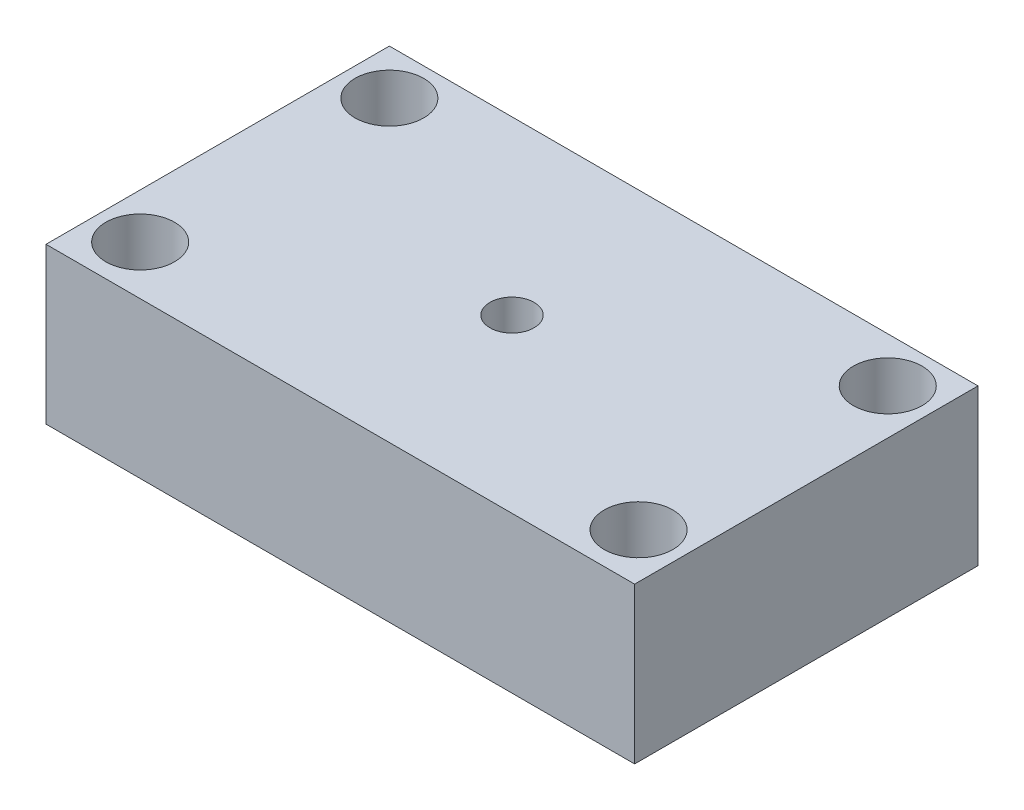
ISO-10303-21;
HEADER;
FILE_DESCRIPTION(('STEP AP214'),'2;1');
FILE_NAME('part.step','',(''),(''),'','','');
FILE_SCHEMA(('AUTOMOTIVE_DESIGN { 1 0 10303 214 1 1 1 1 }'));
ENDSEC;
DATA;
#1=APPLICATION_CONTEXT('core data for automotive mechanical design processes');
#2=APPLICATION_PROTOCOL_DEFINITION('international standard','automotive_design',2000,#1);
#3=PRODUCT_CONTEXT('',#1,'mechanical');
#4=PRODUCT('Part','Part','',(#3));
#5=PRODUCT_RELATED_PRODUCT_CATEGORY('part','',(#4));
#6=PRODUCT_DEFINITION_FORMATION('','',#4);
#7=PRODUCT_DEFINITION_CONTEXT('part definition',#1,'design');
#8=PRODUCT_DEFINITION('design','',#6,#7);
#9=PRODUCT_DEFINITION_SHAPE('','',#8);
#10=(LENGTH_UNIT() NAMED_UNIT(*) SI_UNIT(.MILLI.,.METRE.));
#11=(NAMED_UNIT(*) PLANE_ANGLE_UNIT() SI_UNIT($,.RADIAN.));
#12=(NAMED_UNIT(*) SI_UNIT($,.STERADIAN.) SOLID_ANGLE_UNIT());
#13=UNCERTAINTY_MEASURE_WITH_UNIT(LENGTH_MEASURE(1.E-05),#10,'distance_accuracy_value','');
#14=(GEOMETRIC_REPRESENTATION_CONTEXT(3) GLOBAL_UNCERTAINTY_ASSIGNED_CONTEXT((#13)) GLOBAL_UNIT_ASSIGNED_CONTEXT((#10,
#11,#12)) REPRESENTATION_CONTEXT('',''));
#15=CARTESIAN_POINT('',(0.,0.,0.));
#16=DIRECTION('',(0.,0.,1.));
#17=DIRECTION('',(1.,0.,0.));
#18=AXIS2_PLACEMENT_3D('',#15,#16,#17);
#19=CARTESIAN_POINT('',(0.,15.875,0.));
#20=DIRECTION('',(0.,-1.,0.));
#21=DIRECTION('',(0.,0.,-1.));
#22=AXIS2_PLACEMENT_3D('',#19,#20,#21);
#23=PLANE('',#22);
#24=DIRECTION('',(0.,0.,1.));
#25=VECTOR('',#24,1.);
#26=CARTESIAN_POINT('',(0.,15.875,0.));
#27=LINE('',#26,#25);
#28=CARTESIAN_POINT('',(0.,15.875,-35.));
#29=VERTEX_POINT('',#28);
#30=CARTESIAN_POINT('',(0.,15.875,0.));
#31=VERTEX_POINT('',#30);
#32=EDGE_CURVE('E96',#29,#31,#27,.T.);
#33=ORIENTED_EDGE('',*,*,#32,.T.);
#34=DIRECTION('',(1.,0.,0.));
#35=VECTOR('',#34,1.);
#36=CARTESIAN_POINT('',(0.,15.875,0.));
#37=LINE('',#36,#35);
#38=CARTESIAN_POINT('',(60.,15.875,0.));
#39=VERTEX_POINT('',#38);
#40=EDGE_CURVE('E91',#31,#39,#37,.T.);
#41=ORIENTED_EDGE('',*,*,#40,.T.);
#42=DIRECTION('',(0.,0.,-1.));
#43=VECTOR('',#42,1.);
#44=CARTESIAN_POINT('',(60.,15.875,0.));
#45=LINE('',#44,#43);
#46=CARTESIAN_POINT('',(60.,15.875,-35.));
#47=VERTEX_POINT('',#46);
#48=EDGE_CURVE('E94',#39,#47,#45,.T.);
#49=ORIENTED_EDGE('',*,*,#48,.T.);
#50=DIRECTION('',(-1.,0.,0.));
#51=VECTOR('',#50,1.);
#52=CARTESIAN_POINT('',(0.,15.875,-35.));
#53=LINE('',#52,#51);
#54=EDGE_CURVE('E61',#47,#29,#53,.T.);
#55=ORIENTED_EDGE('',*,*,#54,.T.);
#56=EDGE_LOOP('',(#33,#41,#49,#55));
#57=FACE_BOUND('',#56,.T.);
#58=CARTESIAN_POINT('',(4.6,15.875,-30.4));
#59=DIRECTION('',(0.,1.,0.));
#60=DIRECTION('',(0.,0.,1.));
#61=AXIS2_PLACEMENT_3D('',#58,#59,#60);
#62=CIRCLE('',#61,3.5);
#63=CARTESIAN_POINT('',(4.6,15.875,-26.9));
#64=VERTEX_POINT('',#63);
#65=EDGE_CURVE('E116',#64,#64,#62,.T.);
#66=ORIENTED_EDGE('',*,*,#65,.F.);
#67=EDGE_LOOP('',(#66));
#68=FACE_BOUND('',#67,.T.);
#69=CARTESIAN_POINT('',(55.4,15.875,-30.4));
#70=DIRECTION('',(0.,1.,0.));
#71=DIRECTION('',(0.,0.,1.));
#72=AXIS2_PLACEMENT_3D('',#69,#70,#71);
#73=CIRCLE('',#72,3.5);
#74=CARTESIAN_POINT('',(55.4,15.875,-26.9));
#75=VERTEX_POINT('',#74);
#76=EDGE_CURVE('E138',#75,#75,#73,.T.);
#77=ORIENTED_EDGE('',*,*,#76,.F.);
#78=EDGE_LOOP('',(#77));
#79=FACE_BOUND('',#78,.T.);
#80=CARTESIAN_POINT('',(4.6,15.875,-5.));
#81=DIRECTION('',(0.,1.,0.));
#82=DIRECTION('',(0.,0.,1.));
#83=AXIS2_PLACEMENT_3D('',#80,#81,#82);
#84=CIRCLE('',#83,3.5);
#85=CARTESIAN_POINT('',(4.6,15.875,-1.5));
#86=VERTEX_POINT('',#85);
#87=EDGE_CURVE('E146',#86,#86,#84,.T.);
#88=ORIENTED_EDGE('',*,*,#87,.F.);
#89=EDGE_LOOP('',(#88));
#90=FACE_BOUND('',#89,.T.);
#91=CARTESIAN_POINT('',(55.4,15.875,-5.));
#92=DIRECTION('',(0.,1.,0.));
#93=DIRECTION('',(0.,0.,1.));
#94=AXIS2_PLACEMENT_3D('',#91,#92,#93);
#95=CIRCLE('',#94,3.5);
#96=CARTESIAN_POINT('',(55.4,15.875,-1.5));
#97=VERTEX_POINT('',#96);
#98=EDGE_CURVE('E154',#97,#97,#95,.T.);
#99=ORIENTED_EDGE('',*,*,#98,.F.);
#100=EDGE_LOOP('',(#99));
#101=FACE_BOUND('',#100,.T.);
#102=CARTESIAN_POINT('',(30.,15.875,-17.5));
#103=DIRECTION('',(0.,1.,0.));
#104=DIRECTION('',(0.,0.,1.));
#105=AXIS2_PLACEMENT_3D('',#102,#103,#104);
#106=CIRCLE('',#105,2.25);
#107=CARTESIAN_POINT('',(30.,15.875,-15.25));
#108=VERTEX_POINT('',#107);
#109=EDGE_CURVE('E162',#108,#108,#106,.T.);
#110=ORIENTED_EDGE('',*,*,#109,.F.);
#111=EDGE_LOOP('',(#110));
#112=FACE_BOUND('',#111,.T.);
#113=ADVANCED_FACE('F43',(#57,#68,#79,#90,#101,#112),#23,.F.);
#114=CARTESIAN_POINT('',(0.,0.,0.));
#115=DIRECTION('',(0.,-1.,0.));
#116=DIRECTION('',(0.,0.,-1.));
#117=AXIS2_PLACEMENT_3D('',#114,#115,#116);
#118=PLANE('',#117);
#119=CARTESIAN_POINT('',(55.4,0.,-5.));
#120=DIRECTION('',(0.,1.,0.));
#121=DIRECTION('',(0.,0.,1.));
#122=AXIS2_PLACEMENT_3D('',#119,#120,#121);
#123=CIRCLE('',#122,3.5);
#124=CARTESIAN_POINT('',(55.4,0.,-1.5));
#125=VERTEX_POINT('',#124);
#126=EDGE_CURVE('E158',#125,#125,#123,.T.);
#127=ORIENTED_EDGE('',*,*,#126,.T.);
#128=EDGE_LOOP('',(#127));
#129=FACE_BOUND('',#128,.T.);
#130=CARTESIAN_POINT('',(55.4,0.,-30.4));
#131=DIRECTION('',(0.,1.,0.));
#132=DIRECTION('',(0.,0.,1.));
#133=AXIS2_PLACEMENT_3D('',#130,#131,#132);
#134=CIRCLE('',#133,3.5);
#135=CARTESIAN_POINT('',(55.4,0.,-26.9));
#136=VERTEX_POINT('',#135);
#137=EDGE_CURVE('E142',#136,#136,#134,.T.);
#138=ORIENTED_EDGE('',*,*,#137,.T.);
#139=EDGE_LOOP('',(#138));
#140=FACE_BOUND('',#139,.T.);
#141=DIRECTION('',(0.,0.,1.));
#142=VECTOR('',#141,1.);
#143=CARTESIAN_POINT('',(0.,0.,0.));
#144=LINE('',#143,#142);
#145=CARTESIAN_POINT('',(0.,0.,-35.));
#146=VERTEX_POINT('',#145);
#147=CARTESIAN_POINT('',(0.,0.,0.));
#148=VERTEX_POINT('',#147);
#149=EDGE_CURVE('E112',#146,#148,#144,.T.);
#150=ORIENTED_EDGE('',*,*,#149,.F.);
#151=DIRECTION('',(-1.,0.,0.));
#152=VECTOR('',#151,1.);
#153=CARTESIAN_POINT('',(0.,0.,-35.));
#154=LINE('',#153,#152);
#155=CARTESIAN_POINT('',(60.,0.,-35.));
#156=VERTEX_POINT('',#155);
#157=EDGE_CURVE('E84',#156,#146,#154,.T.);
#158=ORIENTED_EDGE('',*,*,#157,.F.);
#159=DIRECTION('',(0.,0.,-1.));
#160=VECTOR('',#159,1.);
#161=CARTESIAN_POINT('',(60.,0.,0.));
#162=LINE('',#161,#160);
#163=CARTESIAN_POINT('',(60.,0.,0.));
#164=VERTEX_POINT('',#163);
#165=EDGE_CURVE('E78',#164,#156,#162,.T.);
#166=ORIENTED_EDGE('',*,*,#165,.F.);
#167=DIRECTION('',(1.,0.,0.));
#168=VECTOR('',#167,1.);
#169=CARTESIAN_POINT('',(0.,0.,0.));
#170=LINE('',#169,#168);
#171=EDGE_CURVE('E101',#148,#164,#170,.T.);
#172=ORIENTED_EDGE('',*,*,#171,.F.);
#173=EDGE_LOOP('',(#150,#158,#166,#172));
#174=FACE_BOUND('',#173,.T.);
#175=CARTESIAN_POINT('',(4.6,0.,-30.4));
#176=DIRECTION('',(0.,1.,0.));
#177=DIRECTION('',(0.,0.,1.));
#178=AXIS2_PLACEMENT_3D('',#175,#176,#177);
#179=CIRCLE('',#178,3.5);
#180=CARTESIAN_POINT('',(4.6,0.,-26.9));
#181=VERTEX_POINT('',#180);
#182=EDGE_CURVE('E134',#181,#181,#179,.T.);
#183=ORIENTED_EDGE('',*,*,#182,.T.);
#184=EDGE_LOOP('',(#183));
#185=FACE_BOUND('',#184,.T.);
#186=CARTESIAN_POINT('',(4.6,0.,-5.));
#187=DIRECTION('',(0.,1.,0.));
#188=DIRECTION('',(0.,0.,1.));
#189=AXIS2_PLACEMENT_3D('',#186,#187,#188);
#190=CIRCLE('',#189,3.5);
#191=CARTESIAN_POINT('',(4.6,0.,-1.5));
#192=VERTEX_POINT('',#191);
#193=EDGE_CURVE('E150',#192,#192,#190,.T.);
#194=ORIENTED_EDGE('',*,*,#193,.T.);
#195=EDGE_LOOP('',(#194));
#196=FACE_BOUND('',#195,.T.);
#197=CARTESIAN_POINT('',(30.,0.,-17.5));
#198=DIRECTION('',(0.,1.,0.));
#199=DIRECTION('',(0.,0.,1.));
#200=AXIS2_PLACEMENT_3D('',#197,#198,#199);
#201=CIRCLE('',#200,2.25);
#202=CARTESIAN_POINT('',(30.,0.,-15.25));
#203=VERTEX_POINT('',#202);
#204=EDGE_CURVE('E166',#203,#203,#201,.T.);
#205=ORIENTED_EDGE('',*,*,#204,.T.);
#206=EDGE_LOOP('',(#205));
#207=FACE_BOUND('',#206,.T.);
#208=ADVANCED_FACE('F129',(#129,#140,#174,#185,#196,#207),#118,.T.);
#209=CARTESIAN_POINT('',(0.,15.875,0.));
#210=DIRECTION('',(1.,0.,0.));
#211=DIRECTION('',(0.,0.,-1.));
#212=AXIS2_PLACEMENT_3D('',#209,#210,#211);
#213=PLANE('',#212);
#214=ORIENTED_EDGE('',*,*,#149,.T.);
#215=DIRECTION('',(0.,-1.,0.));
#216=VECTOR('',#215,1.);
#217=CARTESIAN_POINT('',(0.,15.875,0.));
#218=LINE('',#217,#216);
#219=EDGE_CURVE('E11',#31,#148,#218,.T.);
#220=ORIENTED_EDGE('',*,*,#219,.F.);
#221=ORIENTED_EDGE('',*,*,#32,.F.);
#222=DIRECTION('',(0.,-1.,0.));
#223=VECTOR('',#222,1.);
#224=CARTESIAN_POINT('',(0.,15.875,-35.));
#225=LINE('',#224,#223);
#226=EDGE_CURVE('E108',#29,#146,#225,.T.);
#227=ORIENTED_EDGE('',*,*,#226,.T.);
#228=EDGE_LOOP('',(#214,#220,#221,#227));
#229=FACE_BOUND('',#228,.T.);
#230=ADVANCED_FACE('F45',(#229),#213,.F.);
#231=CARTESIAN_POINT('',(0.,15.875,0.));
#232=DIRECTION('',(0.,0.,-1.));
#233=DIRECTION('',(-1.,0.,0.));
#234=AXIS2_PLACEMENT_3D('',#231,#232,#233);
#235=PLANE('',#234);
#236=ORIENTED_EDGE('',*,*,#171,.T.);
#237=DIRECTION('',(0.,-1.,0.));
#238=VECTOR('',#237,1.);
#239=CARTESIAN_POINT('',(60.,15.875,0.));
#240=LINE('',#239,#238);
#241=EDGE_CURVE('E53',#39,#164,#240,.T.);
#242=ORIENTED_EDGE('',*,*,#241,.F.);
#243=ORIENTED_EDGE('',*,*,#40,.F.);
#244=ORIENTED_EDGE('',*,*,#219,.T.);
#245=EDGE_LOOP('',(#236,#242,#243,#244));
#246=FACE_BOUND('',#245,.T.);
#247=ADVANCED_FACE('F100',(#246),#235,.F.);
#248=CARTESIAN_POINT('',(60.,15.875,0.));
#249=DIRECTION('',(-1.,0.,0.));
#250=DIRECTION('',(0.,0.,1.));
#251=AXIS2_PLACEMENT_3D('',#248,#249,#250);
#252=PLANE('',#251);
#253=ORIENTED_EDGE('',*,*,#165,.T.);
#254=DIRECTION('',(0.,-1.,0.));
#255=VECTOR('',#254,1.);
#256=CARTESIAN_POINT('',(60.,15.875,-35.));
#257=LINE('',#256,#255);
#258=EDGE_CURVE('E103',#47,#156,#257,.T.);
#259=ORIENTED_EDGE('',*,*,#258,.F.);
#260=ORIENTED_EDGE('',*,*,#48,.F.);
#261=ORIENTED_EDGE('',*,*,#241,.T.);
#262=EDGE_LOOP('',(#253,#259,#260,#261));
#263=FACE_BOUND('',#262,.T.);
#264=ADVANCED_FACE('F104',(#263),#252,.F.);
#265=CARTESIAN_POINT('',(0.,15.875,-35.));
#266=DIRECTION('',(0.,0.,1.));
#267=DIRECTION('',(1.,0.,0.));
#268=AXIS2_PLACEMENT_3D('',#265,#266,#267);
#269=PLANE('',#268);
#270=ORIENTED_EDGE('',*,*,#157,.T.);
#271=ORIENTED_EDGE('',*,*,#226,.F.);
#272=ORIENTED_EDGE('',*,*,#54,.F.);
#273=ORIENTED_EDGE('',*,*,#258,.T.);
#274=EDGE_LOOP('',(#270,#271,#272,#273));
#275=FACE_BOUND('',#274,.T.);
#276=ADVANCED_FACE('F126',(#275),#269,.F.);
#277=CARTESIAN_POINT('',(4.6,15.875,-30.4));
#278=DIRECTION('',(0.,-1.,0.));
#279=DIRECTION('',(0.,0.,-1.));
#280=AXIS2_PLACEMENT_3D('',#277,#278,#279);
#281=CYLINDRICAL_SURFACE('',#280,3.5);
#282=ORIENTED_EDGE('',*,*,#65,.T.);
#283=EDGE_LOOP('',(#282));
#284=FACE_BOUND('',#283,.T.);
#285=ORIENTED_EDGE('',*,*,#182,.F.);
#286=EDGE_LOOP('',(#285));
#287=FACE_BOUND('',#286,.T.);
#288=ADVANCED_FACE('F185',(#284,#287),#281,.F.);
#289=CARTESIAN_POINT('',(55.4,15.875,-30.4));
#290=DIRECTION('',(0.,-1.,0.));
#291=DIRECTION('',(0.,0.,-1.));
#292=AXIS2_PLACEMENT_3D('',#289,#290,#291);
#293=CYLINDRICAL_SURFACE('',#292,3.5);
#294=ORIENTED_EDGE('',*,*,#76,.T.);
#295=EDGE_LOOP('',(#294));
#296=FACE_BOUND('',#295,.T.);
#297=ORIENTED_EDGE('',*,*,#137,.F.);
#298=EDGE_LOOP('',(#297));
#299=FACE_BOUND('',#298,.T.);
#300=ADVANCED_FACE('F239',(#296,#299),#293,.F.);
#301=CARTESIAN_POINT('',(4.6,15.875,-5.));
#302=DIRECTION('',(0.,-1.,0.));
#303=DIRECTION('',(0.,0.,-1.));
#304=AXIS2_PLACEMENT_3D('',#301,#302,#303);
#305=CYLINDRICAL_SURFACE('',#304,3.5);
#306=ORIENTED_EDGE('',*,*,#87,.T.);
#307=EDGE_LOOP('',(#306));
#308=FACE_BOUND('',#307,.T.);
#309=ORIENTED_EDGE('',*,*,#193,.F.);
#310=EDGE_LOOP('',(#309));
#311=FACE_BOUND('',#310,.T.);
#312=ADVANCED_FACE('F248',(#308,#311),#305,.F.);
#313=CARTESIAN_POINT('',(55.4,15.875,-5.));
#314=DIRECTION('',(0.,-1.,0.));
#315=DIRECTION('',(0.,0.,-1.));
#316=AXIS2_PLACEMENT_3D('',#313,#314,#315);
#317=CYLINDRICAL_SURFACE('',#316,3.5);
#318=ORIENTED_EDGE('',*,*,#98,.T.);
#319=EDGE_LOOP('',(#318));
#320=FACE_BOUND('',#319,.T.);
#321=ORIENTED_EDGE('',*,*,#126,.F.);
#322=EDGE_LOOP('',(#321));
#323=FACE_BOUND('',#322,.T.);
#324=ADVANCED_FACE('F257',(#320,#323),#317,.F.);
#325=CARTESIAN_POINT('',(30.,15.875,-17.5));
#326=DIRECTION('',(0.,-1.,0.));
#327=DIRECTION('',(0.,0.,-1.));
#328=AXIS2_PLACEMENT_3D('',#325,#326,#327);
#329=CYLINDRICAL_SURFACE('',#328,2.25);
#330=ORIENTED_EDGE('',*,*,#109,.T.);
#331=EDGE_LOOP('',(#330));
#332=FACE_BOUND('',#331,.T.);
#333=ORIENTED_EDGE('',*,*,#204,.F.);
#334=EDGE_LOOP('',(#333));
#335=FACE_BOUND('',#334,.T.);
#336=ADVANCED_FACE('F174',(#332,#335),#329,.F.);
#337=CLOSED_SHELL('',(#113,#208,#230,#247,#264,#276,#288,#300,#312,#324,#336));
#338=MANIFOLD_SOLID_BREP('B2',#337);
#339=ADVANCED_BREP_SHAPE_REPRESENTATION('',(#18,#338),#14);
#340=SHAPE_DEFINITION_REPRESENTATION(#9,#339);
ENDSEC;
END-ISO-10303-21;
